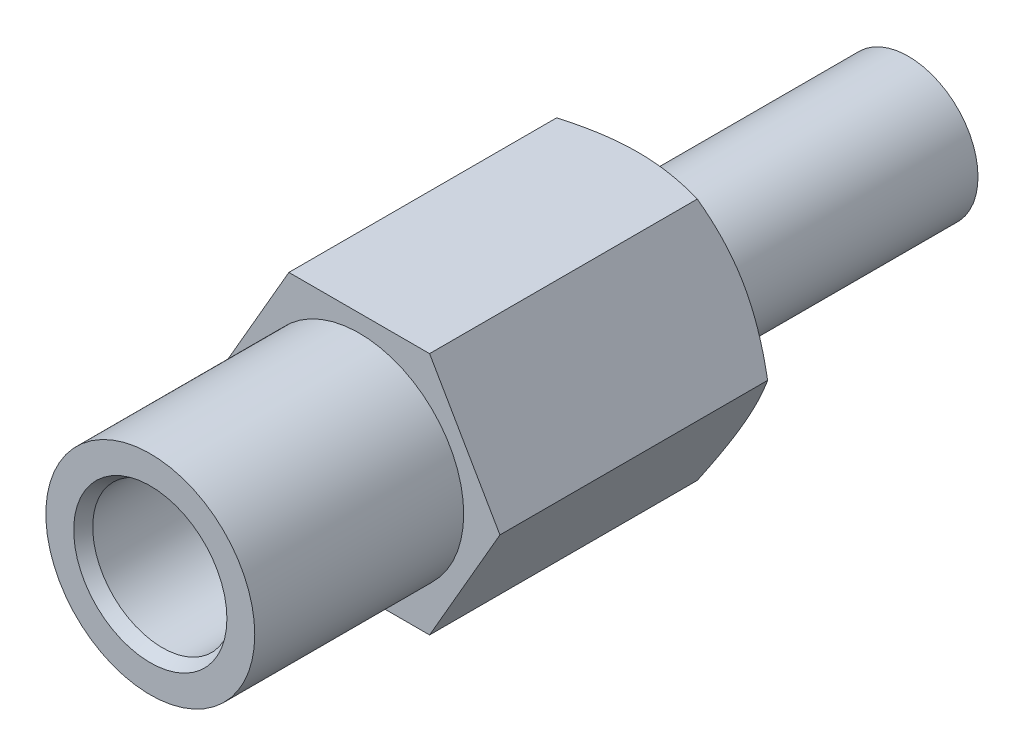
ISO-10303-21;
HEADER;
FILE_DESCRIPTION(('STEP AP214'),'2;1');
FILE_NAME('part.step','',(''),(''),'','','');
FILE_SCHEMA(('AUTOMOTIVE_DESIGN { 1 0 10303 214 1 1 1 1 }'));
ENDSEC;
DATA;
#1=APPLICATION_CONTEXT('core data for automotive mechanical design processes');
#2=APPLICATION_PROTOCOL_DEFINITION('international standard','automotive_design',2000,#1);
#3=PRODUCT_CONTEXT('',#1,'mechanical');
#4=PRODUCT('Part','Part','',(#3));
#5=PRODUCT_RELATED_PRODUCT_CATEGORY('part','',(#4));
#6=PRODUCT_DEFINITION_FORMATION('','',#4);
#7=PRODUCT_DEFINITION_CONTEXT('part definition',#1,'design');
#8=PRODUCT_DEFINITION('design','',#6,#7);
#9=PRODUCT_DEFINITION_SHAPE('','',#8);
#10=(LENGTH_UNIT() NAMED_UNIT(*) SI_UNIT(.MILLI.,.METRE.));
#11=(NAMED_UNIT(*) PLANE_ANGLE_UNIT() SI_UNIT($,.RADIAN.));
#12=(NAMED_UNIT(*) SI_UNIT($,.STERADIAN.) SOLID_ANGLE_UNIT());
#13=UNCERTAINTY_MEASURE_WITH_UNIT(LENGTH_MEASURE(1.E-05),#10,'distance_accuracy_value','');
#14=(GEOMETRIC_REPRESENTATION_CONTEXT(3) GLOBAL_UNCERTAINTY_ASSIGNED_CONTEXT((#13)) GLOBAL_UNIT_ASSIGNED_CONTEXT((#10,
#11,#12)) REPRESENTATION_CONTEXT('',''));
#15=CARTESIAN_POINT('',(0.,0.,0.));
#16=DIRECTION('',(0.,0.,1.));
#17=DIRECTION('',(1.,0.,0.));
#18=AXIS2_PLACEMENT_3D('',#15,#16,#17);
#19=CARTESIAN_POINT('',(4.04,0.,-10.));
#20=DIRECTION('',(-0.866025403784329,-0.50000000000019,0.));
#21=DIRECTION('',(-0.50000000000019,0.866025403784329,0.));
#22=AXIS2_PLACEMENT_3D('',#19,#20,#21);
#23=PLANE('',#22);
#24=DIRECTION('',(-0.50000000000019,0.866025403784329,0.));
#25=VECTOR('',#24,1.);
#26=CARTESIAN_POINT('',(4.04,0.,8.));
#27=LINE('',#26,#25);
#28=CARTESIAN_POINT('',(4.03999999999989,-1.83663848019044E-12,8.));
#29=VERTEX_POINT('',#28);
#30=CARTESIAN_POINT('',(2.02,3.498742631289,8.));
#31=VERTEX_POINT('',#30);
#32=EDGE_CURVE('E291',#29,#31,#27,.T.);
#33=ORIENTED_EDGE('',*,*,#32,.F.);
#34=DIRECTION('',(0.,0.,1.));
#35=VECTOR('',#34,1.);
#36=CARTESIAN_POINT('',(4.04,0.,0.311769145362));
#37=LINE('',#36,#35);
#38=CARTESIAN_POINT('',(4.04,0.,0.311769145362));
#39=VERTEX_POINT('',#38);
#40=EDGE_CURVE('E224',#39,#29,#37,.T.);
#41=ORIENTED_EDGE('',*,*,#40,.F.);
#42=CARTESIAN_POINT('',(4.04000000000133,-9.90540982570565E-13,0.311769145362881));
#43=CARTESIAN_POINT('',(3.52396456189665,0.893799597301923,0.0138359462614438));
#44=CARTESIAN_POINT('',(3.0769041575982,1.66813093159874,-3.10418357685194E-13));
#45=(BOUNDED_CURVE() B_SPLINE_CURVE(2,(#42,#43,#44),.UNSPECIFIED.,.F.,
.F.) B_SPLINE_CURVE_WITH_KNOTS((3,3),(0.,1.),
.UNSPECIFIED.) CURVE() GEOMETRIC_REPRESENTATION_ITEM() RATIONAL_B_SPLINE_CURVE((1.,
1.03431996779337,1.)) REPRESENTATION_ITEM(''));
#46=CARTESIAN_POINT('',(3.076904157598,1.668130931598,0.));
#47=VERTEX_POINT('',#46);
#48=EDGE_CURVE('E200',#39,#47,#45,.T.);
#49=ORIENTED_EDGE('',*,*,#48,.T.);
#50=DIRECTION('',(0.50000000000019,-0.866025403784329,0.));
#51=VECTOR('',#50,1.);
#52=CARTESIAN_POINT('',(3.535,0.874685657822,0.));
#53=LINE('',#52,#51);
#54=CARTESIAN_POINT('',(2.983095842402,1.830611699691,0.));
#55=VERTEX_POINT('',#54);
#56=EDGE_CURVE('E61',#55,#47,#53,.T.);
#57=ORIENTED_EDGE('',*,*,#56,.F.);
#58=CARTESIAN_POINT('',(2.9830958424017,1.83061169969144,-3.07309733216243E-13));
#59=CARTESIAN_POINT('',(2.53603543810382,2.60494303398726,0.0138359462614593));
#60=CARTESIAN_POINT('',(2.01999999999997,3.49874263128873,0.311769145362127));
#61=(BOUNDED_CURVE() B_SPLINE_CURVE(2,(#58,#59,#60),.UNSPECIFIED.,.F.,
.F.) B_SPLINE_CURVE_WITH_KNOTS((3,3),(0.,1.),
.UNSPECIFIED.) CURVE() GEOMETRIC_REPRESENTATION_ITEM() RATIONAL_B_SPLINE_CURVE((1.,
1.03431996779327,1.)) REPRESENTATION_ITEM(''));
#62=CARTESIAN_POINT('',(2.02,3.498742631289,0.311769145362));
#63=VERTEX_POINT('',#62);
#64=EDGE_CURVE('E46',#55,#63,#61,.T.);
#65=ORIENTED_EDGE('',*,*,#64,.T.);
#66=DIRECTION('',(0.,0.,1.));
#67=VECTOR('',#66,1.);
#68=CARTESIAN_POINT('',(2.02,3.498742631289,-10.));
#69=LINE('',#68,#67);
#70=EDGE_CURVE('E197',#63,#31,#69,.T.);
#71=ORIENTED_EDGE('',*,*,#70,.T.);
#72=EDGE_LOOP('',(#33,#41,#49,#57,#65,#71));
#73=FACE_BOUND('',#72,.T.);
#74=ADVANCED_FACE('F38',(#73),#23,.F.);
#75=CARTESIAN_POINT('',(2.02,3.498742631289,-10.));
#76=DIRECTION('',(0.,-1.,0.));
#77=DIRECTION('',(-1.,0.,0.));
#78=AXIS2_PLACEMENT_3D('',#75,#76,#77);
#79=PLANE('',#78);
#80=DIRECTION('',(-1.,0.,0.));
#81=VECTOR('',#80,1.);
#82=CARTESIAN_POINT('',(2.02,3.498742631289,8.));
#83=LINE('',#82,#81);
#84=CARTESIAN_POINT('',(-2.02,3.498742631289,8.));
#85=VERTEX_POINT('',#84);
#86=EDGE_CURVE('E348',#31,#85,#83,.T.);
#87=ORIENTED_EDGE('',*,*,#86,.F.);
#88=ORIENTED_EDGE('',*,*,#70,.F.);
#89=CARTESIAN_POINT('',(2.02000000000038,3.498742631289,0.31176914536222));
#90=CARTESIAN_POINT('',(0.987929123792116,3.498742631289,0.0138359462613506));
#91=CARTESIAN_POINT('',(0.0938083151958985,3.498742631289,-3.18411963462495E-13));
#92=(BOUNDED_CURVE() B_SPLINE_CURVE(2,(#89,#90,#91),.UNSPECIFIED.,.F.,
.F.) B_SPLINE_CURVE_WITH_KNOTS((3,3),(0.,1.),
.UNSPECIFIED.) CURVE() GEOMETRIC_REPRESENTATION_ITEM() RATIONAL_B_SPLINE_CURVE((1.,
1.03431996779331,1.)) REPRESENTATION_ITEM(''));
#93=CARTESIAN_POINT('',(0.09380831519645,3.498742631289,0.));
#94=VERTEX_POINT('',#93);
#95=EDGE_CURVE('E240',#63,#94,#92,.T.);
#96=ORIENTED_EDGE('',*,*,#95,.T.);
#97=DIRECTION('',(1.,0.,0.));
#98=VECTOR('',#97,1.);
#99=CARTESIAN_POINT('',(1.01,3.498742631289,0.));
#100=LINE('',#99,#98);
#101=CARTESIAN_POINT('',(-0.09380831519645,3.498742631289,0.));
#102=VERTEX_POINT('',#101);
#103=EDGE_CURVE('E173',#102,#94,#100,.T.);
#104=ORIENTED_EDGE('',*,*,#103,.F.);
#105=CARTESIAN_POINT('',(-0.0938083151969729,3.498742631289,-3.01980662698042E-13));
#106=CARTESIAN_POINT('',(-0.987929123792486,3.498742631289,0.0138359462615147));
#107=CARTESIAN_POINT('',(-2.01999999999988,3.498742631289,0.311769145362074));
#108=(BOUNDED_CURVE() B_SPLINE_CURVE(2,(#105,#106,#107),.UNSPECIFIED.,.F.,
.F.) B_SPLINE_CURVE_WITH_KNOTS((3,3),(0.,1.),
.UNSPECIFIED.) CURVE() GEOMETRIC_REPRESENTATION_ITEM() RATIONAL_B_SPLINE_CURVE((1.,
1.03431996779325,1.)) REPRESENTATION_ITEM(''));
#109=CARTESIAN_POINT('',(-2.02,3.498742631289,0.311769145362));
#110=VERTEX_POINT('',#109);
#111=EDGE_CURVE('E159',#102,#110,#108,.T.);
#112=ORIENTED_EDGE('',*,*,#111,.T.);
#113=DIRECTION('',(0.,0.,1.));
#114=VECTOR('',#113,1.);
#115=CARTESIAN_POINT('',(-2.02,3.498742631289,-10.));
#116=LINE('',#115,#114);
#117=EDGE_CURVE('E178',#110,#85,#116,.T.);
#118=ORIENTED_EDGE('',*,*,#117,.T.);
#119=EDGE_LOOP('',(#87,#88,#96,#104,#112,#118));
#120=FACE_BOUND('',#119,.T.);
#121=ADVANCED_FACE('F401',(#120),#79,.F.);
#122=CARTESIAN_POINT('',(2.02,-3.498742631289,-10.));
#123=DIRECTION('',(-0.866025403784329,0.50000000000019,0.));
#124=DIRECTION('',(0.,0.,1.));
#125=AXIS2_PLACEMENT_3D('',#122,#123,#124);
#126=PLANE('',#125);
#127=DIRECTION('',(0.50000000000019,0.866025403784329,0.));
#128=VECTOR('',#127,1.);
#129=CARTESIAN_POINT('',(2.02,-3.498742631289,8.));
#130=LINE('',#129,#128);
#131=CARTESIAN_POINT('',(2.02,-3.498742631289,8.));
#132=VERTEX_POINT('',#131);
#133=EDGE_CURVE('E345',#132,#29,#130,.T.);
#134=ORIENTED_EDGE('',*,*,#133,.F.);
#135=DIRECTION('',(0.,0.,1.));
#136=VECTOR('',#135,1.);
#137=CARTESIAN_POINT('',(2.02,-3.498742631289,-10.));
#138=LINE('',#137,#136);
#139=CARTESIAN_POINT('',(2.02,-3.498742631289,0.311769145362));
#140=VERTEX_POINT('',#139);
#141=EDGE_CURVE('E256',#140,#132,#138,.T.);
#142=ORIENTED_EDGE('',*,*,#141,.F.);
#143=CARTESIAN_POINT('',(2.01999999999953,-3.49874263128949,0.311769145362381));
#144=CARTESIAN_POINT('',(2.53603543810393,-2.60494303398705,0.0138359462612943));
#145=CARTESIAN_POINT('',(2.98309584240224,-1.83061169969049,-3.24185123190546E-13));
#146=(BOUNDED_CURVE() B_SPLINE_CURVE(2,(#143,#144,#145),.UNSPECIFIED.,.F.,
.F.) B_SPLINE_CURVE_WITH_KNOTS((3,3),(0.,1.),
.UNSPECIFIED.) CURVE() GEOMETRIC_REPRESENTATION_ITEM() RATIONAL_B_SPLINE_CURVE((1.,
1.03431996779335,1.)) REPRESENTATION_ITEM(''));
#147=CARTESIAN_POINT('',(2.983095842402,-1.830611699691,0.));
#148=VERTEX_POINT('',#147);
#149=EDGE_CURVE('E196',#140,#148,#146,.T.);
#150=ORIENTED_EDGE('',*,*,#149,.T.);
#151=DIRECTION('',(-0.50000000000019,-0.866025403784329,0.));
#152=VECTOR('',#151,1.);
#153=CARTESIAN_POINT('',(2.525,-2.624056973467,0.));
#154=LINE('',#153,#152);
#155=CARTESIAN_POINT('',(3.076904157598,-1.668130931598,0.));
#156=VERTEX_POINT('',#155);
#157=EDGE_CURVE('E201',#156,#148,#154,.T.);
#158=ORIENTED_EDGE('',*,*,#157,.F.);
#159=CARTESIAN_POINT('',(3.07690415759873,-1.66813093159783,-2.94431146130591E-13));
#160=CARTESIAN_POINT('',(3.52396456189653,-0.893799597302148,0.013835946261594));
#161=CARTESIAN_POINT('',(4.04000000000032,-7.69828645275084E-13,0.311769145362294));
#162=(BOUNDED_CURVE() B_SPLINE_CURVE(2,(#159,#160,#161),.UNSPECIFIED.,.F.,
.F.) B_SPLINE_CURVE_WITH_KNOTS((3,3),(0.,1.),
.UNSPECIFIED.) CURVE() GEOMETRIC_REPRESENTATION_ITEM() RATIONAL_B_SPLINE_CURVE((1.,
1.03431996779326,1.)) REPRESENTATION_ITEM(''));
#163=EDGE_CURVE('E245',#156,#39,#162,.T.);
#164=ORIENTED_EDGE('',*,*,#163,.T.);
#165=ORIENTED_EDGE('',*,*,#40,.T.);
#166=EDGE_LOOP('',(#134,#142,#150,#158,#164,#165));
#167=FACE_BOUND('',#166,.T.);
#168=ADVANCED_FACE('F374',(#167),#126,.F.);
#169=CARTESIAN_POINT('',(-2.02,3.498742631289,-10.));
#170=DIRECTION('',(0.866025403784329,-0.50000000000019,0.));
#171=DIRECTION('',(0.,0.,-1.));
#172=AXIS2_PLACEMENT_3D('',#169,#170,#171);
#173=PLANE('',#172);
#174=DIRECTION('',(-0.50000000000019,-0.866025403784329,0.));
#175=VECTOR('',#174,1.);
#176=CARTESIAN_POINT('',(-2.02,3.498742631289,8.));
#177=LINE('',#176,#175);
#178=CARTESIAN_POINT('',(-4.03999999999989,-1.95156391047391E-13,8.));
#179=VERTEX_POINT('',#178);
#180=EDGE_CURVE('E343',#85,#179,#177,.T.);
#181=ORIENTED_EDGE('',*,*,#180,.F.);
#182=ORIENTED_EDGE('',*,*,#117,.F.);
#183=CARTESIAN_POINT('',(-2.01999999999953,3.49874263128949,0.311769145362381));
#184=CARTESIAN_POINT('',(-2.53603543810393,2.60494303398705,0.0138359462612943));
#185=CARTESIAN_POINT('',(-2.98309584240224,1.83061169969049,-3.24185123190546E-13));
#186=(BOUNDED_CURVE() B_SPLINE_CURVE(2,(#183,#184,#185),.UNSPECIFIED.,.F.,
.F.) B_SPLINE_CURVE_WITH_KNOTS((3,3),(0.,1.),
.UNSPECIFIED.) CURVE() GEOMETRIC_REPRESENTATION_ITEM() RATIONAL_B_SPLINE_CURVE((1.,
1.03431996779335,1.)) REPRESENTATION_ITEM(''));
#187=CARTESIAN_POINT('',(-2.983095842402,1.830611699691,0.));
#188=VERTEX_POINT('',#187);
#189=EDGE_CURVE('E157',#110,#188,#186,.T.);
#190=ORIENTED_EDGE('',*,*,#189,.T.);
#191=DIRECTION('',(0.50000000000019,0.866025403784329,0.));
#192=VECTOR('',#191,1.);
#193=CARTESIAN_POINT('',(-2.525,2.624056973467,0.));
#194=LINE('',#193,#192);
#195=CARTESIAN_POINT('',(-3.076904157598,1.668130931598,0.));
#196=VERTEX_POINT('',#195);
#197=EDGE_CURVE('E165',#196,#188,#194,.T.);
#198=ORIENTED_EDGE('',*,*,#197,.F.);
#199=CARTESIAN_POINT('',(-3.07690415759873,1.66813093159783,-2.94431146130591E-13));
#200=CARTESIAN_POINT('',(-3.52396456189654,0.893799597302129,0.0138359462615943));
#201=CARTESIAN_POINT('',(-4.04000000000034,7.30526750203353E-13,0.311769145362306));
#202=(BOUNDED_CURVE() B_SPLINE_CURVE(2,(#199,#200,#201),.UNSPECIFIED.,.F.,
.F.) B_SPLINE_CURVE_WITH_KNOTS((3,3),(0.,1.),
.UNSPECIFIED.) CURVE() GEOMETRIC_REPRESENTATION_ITEM() RATIONAL_B_SPLINE_CURVE((1.,
1.03431996779326,1.)) REPRESENTATION_ITEM(''));
#203=CARTESIAN_POINT('',(-4.04,0.,0.311769145362));
#204=VERTEX_POINT('',#203);
#205=EDGE_CURVE('E163',#196,#204,#202,.T.);
#206=ORIENTED_EDGE('',*,*,#205,.T.);
#207=DIRECTION('',(0.,0.,1.));
#208=VECTOR('',#207,1.);
#209=CARTESIAN_POINT('',(-4.04,0.,-10.));
#210=LINE('',#209,#208);
#211=EDGE_CURVE('E179',#204,#179,#210,.T.);
#212=ORIENTED_EDGE('',*,*,#211,.T.);
#213=EDGE_LOOP('',(#181,#182,#190,#198,#206,#212));
#214=FACE_BOUND('',#213,.T.);
#215=ADVANCED_FACE('F176',(#214),#173,.F.);
#216=CARTESIAN_POINT('',(-4.04,0.,-10.));
#217=DIRECTION('',(0.866025403784329,0.50000000000019,0.));
#218=DIRECTION('',(0.,0.,-1.));
#219=AXIS2_PLACEMENT_3D('',#216,#217,#218);
#220=PLANE('',#219);
#221=DIRECTION('',(0.50000000000019,-0.866025403784329,0.));
#222=VECTOR('',#221,1.);
#223=CARTESIAN_POINT('',(-4.04,0.,8.));
#224=LINE('',#223,#222);
#225=CARTESIAN_POINT('',(-2.02,-3.498742631289,8.));
#226=VERTEX_POINT('',#225);
#227=EDGE_CURVE('E52',#179,#226,#224,.T.);
#228=ORIENTED_EDGE('',*,*,#227,.F.);
#229=ORIENTED_EDGE('',*,*,#211,.F.);
#230=CARTESIAN_POINT('',(-4.04000000000126,8.72191208145523E-13,0.311769145362841));
#231=CARTESIAN_POINT('',(-3.52396456189663,-0.893799597301969,0.013835946261443));
#232=CARTESIAN_POINT('',(-3.0769041575982,-1.66813093159874,-3.10418357685194E-13));
#233=(BOUNDED_CURVE() B_SPLINE_CURVE(2,(#230,#231,#232),.UNSPECIFIED.,.F.,
.F.) B_SPLINE_CURVE_WITH_KNOTS((3,3),(0.,1.),
.UNSPECIFIED.) CURVE() GEOMETRIC_REPRESENTATION_ITEM() RATIONAL_B_SPLINE_CURVE((1.,
1.03431996779336,1.)) REPRESENTATION_ITEM(''));
#234=CARTESIAN_POINT('',(-3.076904157598,-1.668130931598,0.));
#235=VERTEX_POINT('',#234);
#236=EDGE_CURVE('E208',#204,#235,#233,.T.);
#237=ORIENTED_EDGE('',*,*,#236,.T.);
#238=DIRECTION('',(-0.50000000000019,0.866025403784329,0.));
#239=VECTOR('',#238,1.);
#240=CARTESIAN_POINT('',(-3.535,-0.874685657822,0.));
#241=LINE('',#240,#239);
#242=CARTESIAN_POINT('',(-2.983095842402,-1.830611699691,0.));
#243=VERTEX_POINT('',#242);
#244=EDGE_CURVE('E172',#243,#235,#241,.T.);
#245=ORIENTED_EDGE('',*,*,#244,.F.);
#246=CARTESIAN_POINT('',(-2.9830958424017,-1.83061169969144,-3.07309733216243E-13));
#247=CARTESIAN_POINT('',(-2.53603543810382,-2.60494303398726,0.0138359462614593));
#248=CARTESIAN_POINT('',(-2.01999999999997,-3.49874263128873,0.311769145362127));
#249=(BOUNDED_CURVE() B_SPLINE_CURVE(2,(#246,#247,#248),.UNSPECIFIED.,.F.,
.F.) B_SPLINE_CURVE_WITH_KNOTS((3,3),(0.,1.),
.UNSPECIFIED.) CURVE() GEOMETRIC_REPRESENTATION_ITEM() RATIONAL_B_SPLINE_CURVE((1.,
1.03431996779327,1.)) REPRESENTATION_ITEM(''));
#250=CARTESIAN_POINT('',(-2.02,-3.498742631289,0.311769145362));
#251=VERTEX_POINT('',#250);
#252=EDGE_CURVE('E183',#243,#251,#249,.T.);
#253=ORIENTED_EDGE('',*,*,#252,.T.);
#254=DIRECTION('',(0.,0.,1.));
#255=VECTOR('',#254,1.);
#256=CARTESIAN_POINT('',(-2.02,-3.498742631289,-10.));
#257=LINE('',#256,#255);
#258=EDGE_CURVE('E232',#251,#226,#257,.T.);
#259=ORIENTED_EDGE('',*,*,#258,.T.);
#260=EDGE_LOOP('',(#228,#229,#237,#245,#253,#259));
#261=FACE_BOUND('',#260,.T.);
#262=ADVANCED_FACE('F363',(#261),#220,.F.);
#263=CARTESIAN_POINT('',(-2.02,-3.498742631289,-10.));
#264=DIRECTION('',(0.,1.,0.));
#265=DIRECTION('',(1.,0.,0.));
#266=AXIS2_PLACEMENT_3D('',#263,#264,#265);
#267=PLANE('',#266);
#268=DIRECTION('',(1.,0.,0.));
#269=VECTOR('',#268,1.);
#270=CARTESIAN_POINT('',(-2.02,-3.498742631289,8.));
#271=LINE('',#270,#269);
#272=EDGE_CURVE('E11',#226,#132,#271,.T.);
#273=ORIENTED_EDGE('',*,*,#272,.F.);
#274=ORIENTED_EDGE('',*,*,#258,.F.);
#275=CARTESIAN_POINT('',(-2.02000000000038,-3.498742631289,0.311769145362219));
#276=CARTESIAN_POINT('',(-0.987929123792121,-3.49874263128901,0.0138359462613518));
#277=CARTESIAN_POINT('',(-0.0938083151959088,-3.498742631289,-3.18411963462495E-13));
#278=(BOUNDED_CURVE() B_SPLINE_CURVE(2,(#275,#276,#277),.UNSPECIFIED.,.F.,
.F.) B_SPLINE_CURVE_WITH_KNOTS((3,3),(0.,1.),
.UNSPECIFIED.) CURVE() GEOMETRIC_REPRESENTATION_ITEM() RATIONAL_B_SPLINE_CURVE((1.,
1.0343199677933,1.)) REPRESENTATION_ITEM(''));
#279=CARTESIAN_POINT('',(-0.09380831519646,-3.498742631289,0.));
#280=VERTEX_POINT('',#279);
#281=EDGE_CURVE('E251',#251,#280,#278,.T.);
#282=ORIENTED_EDGE('',*,*,#281,.T.);
#283=DIRECTION('',(-1.,0.,0.));
#284=VECTOR('',#283,1.);
#285=CARTESIAN_POINT('',(-1.01,-3.498742631289,0.));
#286=LINE('',#285,#284);
#287=CARTESIAN_POINT('',(0.09380831519645,-3.498742631289,0.));
#288=VERTEX_POINT('',#287);
#289=EDGE_CURVE('E205',#288,#280,#286,.T.);
#290=ORIENTED_EDGE('',*,*,#289,.F.);
#291=CARTESIAN_POINT('',(0.0938083151969725,-3.498742631289,-3.01980662698042E-13));
#292=CARTESIAN_POINT('',(0.987929123792486,-3.498742631289,0.0138359462615148));
#293=CARTESIAN_POINT('',(2.01999999999987,-3.498742631289,0.311769145362074));
#294=(BOUNDED_CURVE() B_SPLINE_CURVE(2,(#291,#292,#293),.UNSPECIFIED.,.F.,
.F.) B_SPLINE_CURVE_WITH_KNOTS((3,3),(0.,1.),
.UNSPECIFIED.) CURVE() GEOMETRIC_REPRESENTATION_ITEM() RATIONAL_B_SPLINE_CURVE((1.,
1.03431996779326,1.)) REPRESENTATION_ITEM(''));
#295=EDGE_CURVE('E209',#288,#140,#294,.T.);
#296=ORIENTED_EDGE('',*,*,#295,.T.);
#297=ORIENTED_EDGE('',*,*,#141,.T.);
#298=EDGE_LOOP('',(#273,#274,#282,#290,#296,#297));
#299=FACE_BOUND('',#298,.T.);
#300=ADVANCED_FACE('F40',(#299),#267,.F.);
#301=CARTESIAN_POINT('',(0.,0.,0.));
#302=DIRECTION('',(0.,0.,1.));
#303=DIRECTION('',(1.,0.,0.));
#304=AXIS2_PLACEMENT_3D('',#301,#302,#303);
#305=CONICAL_SURFACE('',#304,3.5,1.047197551197);
#306=DIRECTION('',(0.866025403784329,0.,0.50000000000019));
#307=VECTOR('',#306,1.);
#308=CARTESIAN_POINT('',(3.5,0.,0.));
#309=LINE('',#308,#307);
#310=CARTESIAN_POINT('',(3.5,0.,0.));
#311=VERTEX_POINT('',#310);
#312=EDGE_CURVE('E162',#311,#39,#309,.T.);
#313=ORIENTED_EDGE('',*,*,#312,.F.);
#314=CARTESIAN_POINT('',(0.,0.,0.));
#315=DIRECTION('',(0.,0.,1.));
#316=DIRECTION('',(1.,0.,0.));
#317=AXIS2_PLACEMENT_3D('',#314,#315,#316);
#318=CIRCLE('',#317,3.5);
#319=EDGE_CURVE('E204',#311,#47,#318,.T.);
#320=ORIENTED_EDGE('',*,*,#319,.T.);
#321=ORIENTED_EDGE('',*,*,#48,.F.);
#322=EDGE_LOOP('',(#313,#320,#321));
#323=FACE_BOUND('',#322,.T.);
#324=ADVANCED_FACE('F383',(#323),#305,.T.);
#325=CARTESIAN_POINT('',(0.,0.,0.));
#326=DIRECTION('',(0.,0.,1.));
#327=DIRECTION('',(1.,0.,0.));
#328=AXIS2_PLACEMENT_3D('',#325,#326,#327);
#329=PLANE('',#328);
#330=ORIENTED_EDGE('',*,*,#319,.F.);
#331=CARTESIAN_POINT('',(0.,0.,0.));
#332=DIRECTION('',(0.,0.,1.));
#333=DIRECTION('',(1.,0.,0.));
#334=AXIS2_PLACEMENT_3D('',#331,#332,#333);
#335=CIRCLE('',#334,3.5);
#336=EDGE_CURVE('E193',#156,#311,#335,.T.);
#337=ORIENTED_EDGE('',*,*,#336,.F.);
#338=ORIENTED_EDGE('',*,*,#157,.T.);
#339=CARTESIAN_POINT('',(0.,0.,0.));
#340=DIRECTION('',(0.,0.,1.));
#341=DIRECTION('',(1.,0.,0.));
#342=AXIS2_PLACEMENT_3D('',#339,#340,#341);
#343=CIRCLE('',#342,3.5);
#344=EDGE_CURVE('E257',#288,#148,#343,.T.);
#345=ORIENTED_EDGE('',*,*,#344,.F.);
#346=ORIENTED_EDGE('',*,*,#289,.T.);
#347=CARTESIAN_POINT('',(0.,0.,0.));
#348=DIRECTION('',(0.,0.,1.));
#349=DIRECTION('',(1.,0.,0.));
#350=AXIS2_PLACEMENT_3D('',#347,#348,#349);
#351=CIRCLE('',#350,3.5);
#352=EDGE_CURVE('E206',#243,#280,#351,.T.);
#353=ORIENTED_EDGE('',*,*,#352,.F.);
#354=ORIENTED_EDGE('',*,*,#244,.T.);
#355=CARTESIAN_POINT('',(0.,0.,0.));
#356=DIRECTION('',(0.,0.,1.));
#357=DIRECTION('',(1.,0.,0.));
#358=AXIS2_PLACEMENT_3D('',#355,#356,#357);
#359=CIRCLE('',#358,3.5);
#360=EDGE_CURVE('E148',#196,#235,#359,.T.);
#361=ORIENTED_EDGE('',*,*,#360,.F.);
#362=ORIENTED_EDGE('',*,*,#197,.T.);
#363=CARTESIAN_POINT('',(0.,0.,0.));
#364=DIRECTION('',(0.,0.,1.));
#365=DIRECTION('',(1.,0.,0.));
#366=AXIS2_PLACEMENT_3D('',#363,#364,#365);
#367=CIRCLE('',#366,3.5);
#368=EDGE_CURVE('E154',#102,#188,#367,.T.);
#369=ORIENTED_EDGE('',*,*,#368,.F.);
#370=ORIENTED_EDGE('',*,*,#103,.T.);
#371=CARTESIAN_POINT('',(0.,0.,0.));
#372=DIRECTION('',(0.,0.,1.));
#373=DIRECTION('',(1.,0.,0.));
#374=AXIS2_PLACEMENT_3D('',#371,#372,#373);
#375=CIRCLE('',#374,3.5);
#376=EDGE_CURVE('E238',#55,#94,#375,.T.);
#377=ORIENTED_EDGE('',*,*,#376,.F.);
#378=ORIENTED_EDGE('',*,*,#56,.T.);
#379=EDGE_LOOP('',(#330,#337,#338,#345,#346,#353,#354,#361,#362,#369,#370,#377,#378));
#380=FACE_BOUND('',#379,.T.);
#381=CARTESIAN_POINT('',(0.,0.,0.));
#382=DIRECTION('',(0.,0.,1.));
#383=DIRECTION('',(1.,0.,0.));
#384=AXIS2_PLACEMENT_3D('',#381,#382,#383);
#385=CIRCLE('',#384,2.);
#386=CARTESIAN_POINT('',(2.,0.,0.));
#387=VERTEX_POINT('',#386);
#388=EDGE_CURVE('E233',#387,#387,#385,.T.);
#389=ORIENTED_EDGE('',*,*,#388,.T.);
#390=EDGE_LOOP('',(#389));
#391=FACE_BOUND('',#390,.T.);
#392=ADVANCED_FACE('F167',(#380,#391),#329,.F.);
#393=CARTESIAN_POINT('',(0.,0.,0.));
#394=DIRECTION('',(0.,0.,1.));
#395=DIRECTION('',(1.,0.,0.));
#396=AXIS2_PLACEMENT_3D('',#393,#394,#395);
#397=CONICAL_SURFACE('',#396,3.5,1.047197551197);
#398=ORIENTED_EDGE('',*,*,#64,.F.);
#399=ORIENTED_EDGE('',*,*,#376,.T.);
#400=ORIENTED_EDGE('',*,*,#95,.F.);
#401=EDGE_LOOP('',(#398,#399,#400));
#402=FACE_BOUND('',#401,.T.);
#403=ADVANCED_FACE('F388',(#402),#397,.T.);
#404=CARTESIAN_POINT('',(0.,0.,0.));
#405=DIRECTION('',(0.,0.,1.));
#406=DIRECTION('',(1.,0.,0.));
#407=AXIS2_PLACEMENT_3D('',#404,#405,#406);
#408=CONICAL_SURFACE('',#407,3.5,1.047197551197);
#409=ORIENTED_EDGE('',*,*,#336,.T.);
#410=ORIENTED_EDGE('',*,*,#312,.T.);
#411=ORIENTED_EDGE('',*,*,#163,.F.);
#412=EDGE_LOOP('',(#409,#410,#411));
#413=FACE_BOUND('',#412,.T.);
#414=ADVANCED_FACE('F386',(#413),#408,.T.);
#415=CARTESIAN_POINT('',(0.,0.,0.));
#416=DIRECTION('',(0.,0.,1.));
#417=DIRECTION('',(1.,0.,0.));
#418=AXIS2_PLACEMENT_3D('',#415,#416,#417);
#419=CONICAL_SURFACE('',#418,3.5,1.047197551197);
#420=ORIENTED_EDGE('',*,*,#189,.F.);
#421=ORIENTED_EDGE('',*,*,#111,.F.);
#422=ORIENTED_EDGE('',*,*,#368,.T.);
#423=EDGE_LOOP('',(#420,#421,#422));
#424=FACE_BOUND('',#423,.T.);
#425=ADVANCED_FACE('F155',(#424),#419,.T.);
#426=CARTESIAN_POINT('',(0.,0.,0.));
#427=DIRECTION('',(0.,0.,1.));
#428=DIRECTION('',(1.,0.,0.));
#429=AXIS2_PLACEMENT_3D('',#426,#427,#428);
#430=CONICAL_SURFACE('',#429,3.5,1.047197551197);
#431=ORIENTED_EDGE('',*,*,#236,.F.);
#432=ORIENTED_EDGE('',*,*,#205,.F.);
#433=ORIENTED_EDGE('',*,*,#360,.T.);
#434=EDGE_LOOP('',(#431,#432,#433));
#435=FACE_BOUND('',#434,.T.);
#436=ADVANCED_FACE('F394',(#435),#430,.T.);
#437=CARTESIAN_POINT('',(0.,0.,0.));
#438=DIRECTION('',(0.,0.,1.));
#439=DIRECTION('',(1.,0.,0.));
#440=AXIS2_PLACEMENT_3D('',#437,#438,#439);
#441=CONICAL_SURFACE('',#440,3.5,1.047197551197);
#442=ORIENTED_EDGE('',*,*,#281,.F.);
#443=ORIENTED_EDGE('',*,*,#252,.F.);
#444=ORIENTED_EDGE('',*,*,#352,.T.);
#445=EDGE_LOOP('',(#442,#443,#444));
#446=FACE_BOUND('',#445,.T.);
#447=ADVANCED_FACE('F448',(#446),#441,.T.);
#448=CARTESIAN_POINT('',(0.,0.,0.));
#449=DIRECTION('',(0.,0.,1.));
#450=DIRECTION('',(1.,0.,0.));
#451=AXIS2_PLACEMENT_3D('',#448,#449,#450);
#452=CONICAL_SURFACE('',#451,3.5,1.047197551197);
#453=ORIENTED_EDGE('',*,*,#344,.T.);
#454=ORIENTED_EDGE('',*,*,#149,.F.);
#455=ORIENTED_EDGE('',*,*,#295,.F.);
#456=EDGE_LOOP('',(#453,#454,#455));
#457=FACE_BOUND('',#456,.T.);
#458=ADVANCED_FACE('F444',(#457),#452,.T.);
#459=CARTESIAN_POINT('',(0.,0.,-7.769059892324));
#460=DIRECTION('',(0.,0.,1.));
#461=DIRECTION('',(1.,0.,0.));
#462=AXIS2_PLACEMENT_3D('',#459,#460,#461);
#463=CYLINDRICAL_SURFACE('',#462,2.);
#464=CARTESIAN_POINT('',(0.,0.,-7.769059892324));
#465=DIRECTION('',(0.,0.,1.));
#466=DIRECTION('',(1.,0.,0.));
#467=AXIS2_PLACEMENT_3D('',#464,#465,#466);
#468=CIRCLE('',#467,2.);
#469=CARTESIAN_POINT('',(2.,0.,-7.769059892324));
#470=VERTEX_POINT('',#469);
#471=EDGE_CURVE('E296',#470,#470,#468,.T.);
#472=ORIENTED_EDGE('',*,*,#471,.T.);
#473=DIRECTION('',(0.,0.,1.));
#474=VECTOR('',#473,1.);
#475=CARTESIAN_POINT('',(2.,0.,-7.769059892324));
#476=LINE('',#475,#474);
#477=EDGE_CURVE('E213',#470,#387,#476,.T.);
#478=ORIENTED_EDGE('',*,*,#477,.T.);
#479=ORIENTED_EDGE('',*,*,#388,.F.);
#480=ORIENTED_EDGE('',*,*,#477,.F.);
#481=EDGE_LOOP('',(#472,#478,#479,#480));
#482=FACE_BOUND('',#481,.T.);
#483=ADVANCED_FACE('F447',(#482),#463,.T.);
#484=CARTESIAN_POINT('',(0.,0.,-8.));
#485=DIRECTION('',(0.,0.,1.));
#486=DIRECTION('',(1.,0.,0.));
#487=AXIS2_PLACEMENT_3D('',#484,#485,#486);
#488=CONICAL_SURFACE('',#487,1.6,1.047197551197);
#489=CARTESIAN_POINT('',(0.,0.,-8.));
#490=DIRECTION('',(0.,0.,1.));
#491=DIRECTION('',(1.,0.,0.));
#492=AXIS2_PLACEMENT_3D('',#489,#490,#491);
#493=CIRCLE('',#492,1.6);
#494=CARTESIAN_POINT('',(1.6,0.,-8.));
#495=VERTEX_POINT('',#494);
#496=EDGE_CURVE('E275',#495,#495,#493,.T.);
#497=ORIENTED_EDGE('',*,*,#496,.T.);
#498=DIRECTION('',(0.866025403784329,0.,0.50000000000019));
#499=VECTOR('',#498,1.);
#500=CARTESIAN_POINT('',(1.6,0.,-8.));
#501=LINE('',#500,#499);
#502=EDGE_CURVE('E263',#495,#470,#501,.T.);
#503=ORIENTED_EDGE('',*,*,#502,.T.);
#504=ORIENTED_EDGE('',*,*,#471,.F.);
#505=ORIENTED_EDGE('',*,*,#502,.F.);
#506=EDGE_LOOP('',(#497,#503,#504,#505));
#507=FACE_BOUND('',#506,.T.);
#508=ADVANCED_FACE('F442',(#507),#488,.T.);
#509=CARTESIAN_POINT('',(0.,0.,-8.));
#510=DIRECTION('',(0.,0.,1.));
#511=DIRECTION('',(1.,0.,0.));
#512=AXIS2_PLACEMENT_3D('',#509,#510,#511);
#513=PLANE('',#512);
#514=ORIENTED_EDGE('',*,*,#496,.F.);
#515=EDGE_LOOP('',(#514));
#516=FACE_BOUND('',#515,.T.);
#517=ADVANCED_FACE('F439',(#516),#513,.F.);
#518=CARTESIAN_POINT('',(0.,0.,8.));
#519=DIRECTION('',(0.,0.,1.));
#520=DIRECTION('',(1.,0.,0.));
#521=AXIS2_PLACEMENT_3D('',#518,#519,#520);
#522=PLANE('',#521);
#523=CARTESIAN_POINT('',(0.,0.,8.));
#524=DIRECTION('',(0.,0.,1.));
#525=DIRECTION('',(1.,0.,0.));
#526=AXIS2_PLACEMENT_3D('',#523,#524,#525);
#527=CIRCLE('',#526,3.);
#528=CARTESIAN_POINT('',(3.,0.,8.));
#529=VERTEX_POINT('',#528);
#530=EDGE_CURVE('E337',#529,#529,#527,.T.);
#531=ORIENTED_EDGE('',*,*,#530,.F.);
#532=EDGE_LOOP('',(#531));
#533=FACE_BOUND('',#532,.T.);
#534=ORIENTED_EDGE('',*,*,#32,.T.);
#535=ORIENTED_EDGE('',*,*,#86,.T.);
#536=ORIENTED_EDGE('',*,*,#180,.T.);
#537=ORIENTED_EDGE('',*,*,#227,.T.);
#538=ORIENTED_EDGE('',*,*,#272,.T.);
#539=ORIENTED_EDGE('',*,*,#133,.T.);
#540=EDGE_LOOP('',(#534,#535,#536,#537,#538,#539));
#541=FACE_BOUND('',#540,.T.);
#542=ADVANCED_FACE('F370',(#533,#541),#522,.T.);
#543=CARTESIAN_POINT('',(0.,0.,8.));
#544=DIRECTION('',(0.,0.,1.));
#545=DIRECTION('',(1.,0.,0.));
#546=AXIS2_PLACEMENT_3D('',#543,#544,#545);
#547=CYLINDRICAL_SURFACE('',#546,3.);
#548=ORIENTED_EDGE('',*,*,#530,.T.);
#549=EDGE_LOOP('',(#548));
#550=FACE_BOUND('',#549,.T.);
#551=CARTESIAN_POINT('',(0.,0.,14.));
#552=DIRECTION('',(0.,0.,1.));
#553=DIRECTION('',(1.,0.,0.));
#554=AXIS2_PLACEMENT_3D('',#551,#552,#553);
#555=CIRCLE('',#554,3.);
#556=CARTESIAN_POINT('',(3.,0.,14.));
#557=VERTEX_POINT('',#556);
#558=EDGE_CURVE('E335',#557,#557,#555,.T.);
#559=ORIENTED_EDGE('',*,*,#558,.F.);
#560=EDGE_LOOP('',(#559));
#561=FACE_BOUND('',#560,.T.);
#562=ADVANCED_FACE('F432',(#550,#561),#547,.T.);
#563=CARTESIAN_POINT('',(0.,0.,6.));
#564=DIRECTION('',(0.,0.,1.));
#565=DIRECTION('',(1.,0.,0.));
#566=AXIS2_PLACEMENT_3D('',#563,#564,#565);
#567=CONICAL_SURFACE('',#566,2.,1.047197551197);
#568=CARTESIAN_POINT('',(0.,0.,6.));
#569=DIRECTION('',(0.,0.,1.));
#570=DIRECTION('',(1.,0.,0.));
#571=AXIS2_PLACEMENT_3D('',#568,#569,#570);
#572=CIRCLE('',#571,2.);
#573=CARTESIAN_POINT('',(2.,0.,6.));
#574=VERTEX_POINT('',#573);
#575=EDGE_CURVE('E127',#574,#574,#572,.T.);
#576=ORIENTED_EDGE('',*,*,#575,.T.);
#577=DIRECTION('',(-0.866025403784329,0.,-0.50000000000019));
#578=VECTOR('',#577,1.);
#579=CARTESIAN_POINT('',(2.,0.,6.));
#580=LINE('',#579,#578);
#581=CARTESIAN_POINT('',(0.,0.,4.845299461621));
#582=VERTEX_POINT('',#581);
#583=EDGE_CURVE('E134',#574,#582,#580,.T.);
#584=ORIENTED_EDGE('',*,*,#583,.T.);
#585=ORIENTED_EDGE('',*,*,#583,.F.);
#586=EDGE_LOOP('',(#576,#584,#585));
#587=FACE_BOUND('',#586,.T.);
#588=ADVANCED_FACE('F323',(#587),#567,.F.);
#589=CARTESIAN_POINT('',(0.,0.,13.653589838486));
#590=DIRECTION('',(0.,0.,-1.));
#591=DIRECTION('',(1.,0.,0.));
#592=AXIS2_PLACEMENT_3D('',#589,#590,#591);
#593=CYLINDRICAL_SURFACE('',#592,2.);
#594=CARTESIAN_POINT('',(0.,0.,13.653589838486));
#595=DIRECTION('',(0.,0.,1.));
#596=DIRECTION('',(1.,0.,0.));
#597=AXIS2_PLACEMENT_3D('',#594,#595,#596);
#598=CIRCLE('',#597,2.);
#599=CARTESIAN_POINT('',(2.,0.,13.653589838486));
#600=VERTEX_POINT('',#599);
#601=EDGE_CURVE('E217',#600,#600,#598,.T.);
#602=ORIENTED_EDGE('',*,*,#601,.T.);
#603=DIRECTION('',(0.,0.,-1.));
#604=VECTOR('',#603,1.);
#605=CARTESIAN_POINT('',(2.,0.,13.653589838486));
#606=LINE('',#605,#604);
#607=EDGE_CURVE('E215',#600,#574,#606,.T.);
#608=ORIENTED_EDGE('',*,*,#607,.T.);
#609=ORIENTED_EDGE('',*,*,#575,.F.);
#610=ORIENTED_EDGE('',*,*,#607,.F.);
#611=EDGE_LOOP('',(#602,#608,#609,#610));
#612=FACE_BOUND('',#611,.T.);
#613=ADVANCED_FACE('F324',(#612),#593,.F.);
#614=CARTESIAN_POINT('',(0.,0.,14.));
#615=DIRECTION('',(0.,0.,1.));
#616=DIRECTION('',(1.,0.,0.));
#617=AXIS2_PLACEMENT_3D('',#614,#615,#616);
#618=CONICAL_SURFACE('',#617,2.2,0.523598775598);
#619=CARTESIAN_POINT('',(0.,0.,14.));
#620=DIRECTION('',(0.,0.,1.));
#621=DIRECTION('',(1.,0.,0.));
#622=AXIS2_PLACEMENT_3D('',#619,#620,#621);
#623=CIRCLE('',#622,2.2);
#624=CARTESIAN_POINT('',(2.2,0.,14.));
#625=VERTEX_POINT('',#624);
#626=EDGE_CURVE('E210',#625,#625,#623,.T.);
#627=ORIENTED_EDGE('',*,*,#626,.T.);
#628=DIRECTION('',(-0.50000000000019,0.,-0.866025403784329));
#629=VECTOR('',#628,1.);
#630=CARTESIAN_POINT('',(2.2,0.,14.));
#631=LINE('',#630,#629);
#632=EDGE_CURVE('E214',#625,#600,#631,.T.);
#633=ORIENTED_EDGE('',*,*,#632,.T.);
#634=ORIENTED_EDGE('',*,*,#601,.F.);
#635=ORIENTED_EDGE('',*,*,#632,.F.);
#636=EDGE_LOOP('',(#627,#633,#634,#635));
#637=FACE_BOUND('',#636,.T.);
#638=ADVANCED_FACE('F327',(#637),#618,.F.);
#639=CARTESIAN_POINT('',(0.,0.,14.));
#640=DIRECTION('',(0.,0.,1.));
#641=DIRECTION('',(1.,0.,0.));
#642=AXIS2_PLACEMENT_3D('',#639,#640,#641);
#643=PLANE('',#642);
#644=ORIENTED_EDGE('',*,*,#626,.F.);
#645=EDGE_LOOP('',(#644));
#646=FACE_BOUND('',#645,.T.);
#647=ORIENTED_EDGE('',*,*,#558,.T.);
#648=EDGE_LOOP('',(#647));
#649=FACE_BOUND('',#648,.T.);
#650=ADVANCED_FACE('F329',(#646,#649),#643,.T.);
#651=CLOSED_SHELL('',(#74,#121,#168,#215,#262,#300,#324,#392,#403,#414,#425,#436,#447,#458,#483,
#508,#517,#542,#562,#588,#613,#638,#650));
#652=MANIFOLD_SOLID_BREP('B2',#651);
#653=ADVANCED_BREP_SHAPE_REPRESENTATION('',(#18,#652),#14);
#654=SHAPE_DEFINITION_REPRESENTATION(#9,#653);
ENDSEC;
END-ISO-10303-21;
